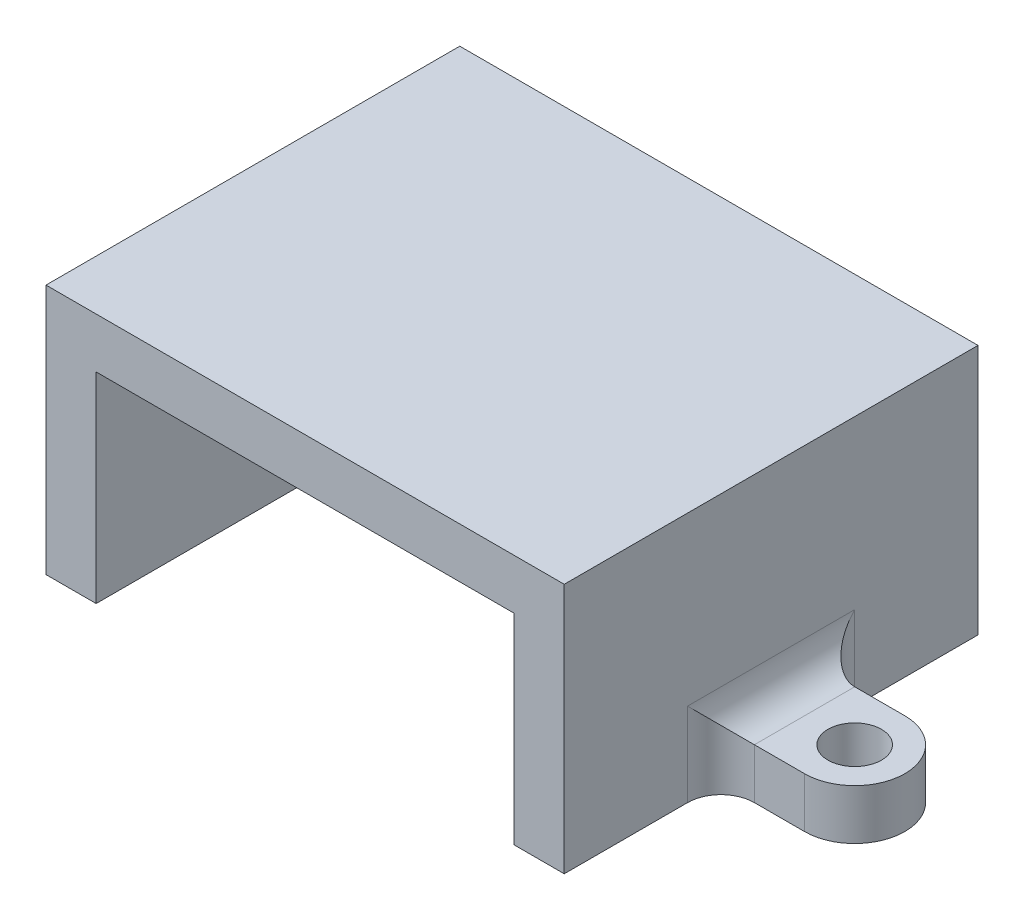
ISO-10303-21;
HEADER;
FILE_DESCRIPTION(('STEP AP214'),'2;1');
FILE_NAME('part.step','',(''),(''),'','','');
FILE_SCHEMA(('AUTOMOTIVE_DESIGN { 1 0 10303 214 1 1 1 1 }'));
ENDSEC;
DATA;
#1=APPLICATION_CONTEXT('core data for automotive mechanical design processes');
#2=APPLICATION_PROTOCOL_DEFINITION('international standard','automotive_design',2000,#1);
#3=PRODUCT_CONTEXT('',#1,'mechanical');
#4=PRODUCT('Part','Part','',(#3));
#5=PRODUCT_RELATED_PRODUCT_CATEGORY('part','',(#4));
#6=PRODUCT_DEFINITION_FORMATION('','',#4);
#7=PRODUCT_DEFINITION_CONTEXT('part definition',#1,'design');
#8=PRODUCT_DEFINITION('design','',#6,#7);
#9=PRODUCT_DEFINITION_SHAPE('','',#8);
#10=(LENGTH_UNIT() NAMED_UNIT(*) SI_UNIT(.MILLI.,.METRE.));
#11=(NAMED_UNIT(*) PLANE_ANGLE_UNIT() SI_UNIT($,.RADIAN.));
#12=(NAMED_UNIT(*) SI_UNIT($,.STERADIAN.) SOLID_ANGLE_UNIT());
#13=UNCERTAINTY_MEASURE_WITH_UNIT(LENGTH_MEASURE(1.E-05),#10,'distance_accuracy_value','');
#14=(GEOMETRIC_REPRESENTATION_CONTEXT(3) GLOBAL_UNCERTAINTY_ASSIGNED_CONTEXT((#13)) GLOBAL_UNIT_ASSIGNED_CONTEXT((#10,
#11,#12)) REPRESENTATION_CONTEXT('',''));
#15=CARTESIAN_POINT('',(0.,0.,0.));
#16=DIRECTION('',(0.,0.,1.));
#17=DIRECTION('',(1.,0.,0.));
#18=AXIS2_PLACEMENT_3D('',#15,#16,#17);
#19=CARTESIAN_POINT('',(31.,0.,24.75));
#20=DIRECTION('',(-1.,0.,0.));
#21=DIRECTION('',(0.,0.,1.));
#22=AXIS2_PLACEMENT_3D('',#19,#20,#21);
#23=PLANE('',#22);
#24=DIRECTION('',(0.,0.,-1.));
#25=VECTOR('',#24,1.);
#26=CARTESIAN_POINT('',(31.,0.,24.75));
#27=LINE('',#26,#25);
#28=CARTESIAN_POINT('',(31.,0.,24.75));
#29=VERTEX_POINT('',#28);
#30=CARTESIAN_POINT('',(31.,0.,17.375));
#31=VERTEX_POINT('',#30);
#32=EDGE_CURVE('E321',#29,#31,#27,.T.);
#33=ORIENTED_EDGE('',*,*,#32,.T.);
#34=DIRECTION('',(0.,-1.,0.));
#35=VECTOR('',#34,1.);
#36=CARTESIAN_POINT('',(31.,0.,17.375));
#37=LINE('',#36,#35);
#38=CARTESIAN_POINT('',(31.,5.,17.375));
#39=VERTEX_POINT('',#38);
#40=EDGE_CURVE('E374',#31,#39,#37,.F.);
#41=ORIENTED_EDGE('',*,*,#40,.T.);
#42=DIRECTION('',(0.,0.,-1.));
#43=VECTOR('',#42,1.);
#44=CARTESIAN_POINT('',(31.,5.,9.375));
#45=LINE('',#44,#43);
#46=CARTESIAN_POINT('',(31.,5.,7.375));
#47=VERTEX_POINT('',#46);
#48=EDGE_CURVE('E368',#39,#47,#45,.T.);
#49=ORIENTED_EDGE('',*,*,#48,.T.);
#50=DIRECTION('',(0.,-1.,0.));
#51=VECTOR('',#50,1.);
#52=CARTESIAN_POINT('',(31.,0.,7.375));
#53=LINE('',#52,#51);
#54=CARTESIAN_POINT('',(31.,0.,7.375));
#55=VERTEX_POINT('',#54);
#56=EDGE_CURVE('E371',#47,#55,#53,.T.);
#57=ORIENTED_EDGE('',*,*,#56,.T.);
#58=CARTESIAN_POINT('',(31.,0.,0.));
#59=VERTEX_POINT('',#58);
#60=EDGE_CURVE('E320',#55,#59,#27,.T.);
#61=ORIENTED_EDGE('',*,*,#60,.T.);
#62=DIRECTION('',(0.,1.,0.));
#63=VECTOR('',#62,1.);
#64=CARTESIAN_POINT('',(31.,0.,0.));
#65=LINE('',#64,#63);
#66=CARTESIAN_POINT('',(31.,15.,0.));
#67=VERTEX_POINT('',#66);
#68=EDGE_CURVE('E308',#59,#67,#65,.T.);
#69=ORIENTED_EDGE('',*,*,#68,.T.);
#70=DIRECTION('',(0.,0.,-1.));
#71=VECTOR('',#70,1.);
#72=CARTESIAN_POINT('',(31.,15.,24.75));
#73=LINE('',#72,#71);
#74=CARTESIAN_POINT('',(31.,15.,24.75));
#75=VERTEX_POINT('',#74);
#76=EDGE_CURVE('E316',#75,#67,#73,.T.);
#77=ORIENTED_EDGE('',*,*,#76,.F.);
#78=DIRECTION('',(0.,1.,0.));
#79=VECTOR('',#78,1.);
#80=CARTESIAN_POINT('',(31.,0.,24.75));
#81=LINE('',#80,#79);
#82=EDGE_CURVE('E282',#29,#75,#81,.T.);
#83=ORIENTED_EDGE('',*,*,#82,.F.);
#84=EDGE_LOOP('',(#33,#41,#49,#57,#61,#69,#77,#83));
#85=FACE_BOUND('',#84,.T.);
#86=ADVANCED_FACE('F39',(#85),#23,.F.);
#87=CARTESIAN_POINT('',(0.,15.,24.75));
#88=DIRECTION('',(1.,0.,0.));
#89=DIRECTION('',(0.,0.,-1.));
#90=AXIS2_PLACEMENT_3D('',#87,#88,#89);
#91=PLANE('',#90);
#92=DIRECTION('',(0.,0.,1.));
#93=VECTOR('',#92,1.);
#94=CARTESIAN_POINT('',(0.,5.,24.75));
#95=LINE('',#94,#93);
#96=CARTESIAN_POINT('',(0.,5.,7.375));
#97=VERTEX_POINT('',#96);
#98=CARTESIAN_POINT('',(0.,5.,17.375));
#99=VERTEX_POINT('',#98);
#100=EDGE_CURVE('E346',#97,#99,#95,.T.);
#101=ORIENTED_EDGE('',*,*,#100,.T.);
#102=DIRECTION('',(0.,-1.,0.));
#103=VECTOR('',#102,1.);
#104=CARTESIAN_POINT('',(0.,15.,17.375));
#105=LINE('',#104,#103);
#106=CARTESIAN_POINT('',(0.,0.,17.375));
#107=VERTEX_POINT('',#106);
#108=EDGE_CURVE('E352',#99,#107,#105,.T.);
#109=ORIENTED_EDGE('',*,*,#108,.T.);
#110=DIRECTION('',(0.,0.,-1.));
#111=VECTOR('',#110,1.);
#112=CARTESIAN_POINT('',(0.,0.,24.75));
#113=LINE('',#112,#111);
#114=CARTESIAN_POINT('',(0.,0.,24.75));
#115=VERTEX_POINT('',#114);
#116=EDGE_CURVE('E342',#115,#107,#113,.T.);
#117=ORIENTED_EDGE('',*,*,#116,.F.);
#118=DIRECTION('',(0.,-1.,0.));
#119=VECTOR('',#118,1.);
#120=CARTESIAN_POINT('',(0.,15.,24.75));
#121=LINE('',#120,#119);
#122=CARTESIAN_POINT('',(0.,15.,24.75));
#123=VERTEX_POINT('',#122);
#124=EDGE_CURVE('E262',#123,#115,#121,.T.);
#125=ORIENTED_EDGE('',*,*,#124,.F.);
#126=DIRECTION('',(0.,0.,-1.));
#127=VECTOR('',#126,1.);
#128=CARTESIAN_POINT('',(0.,15.,24.75));
#129=LINE('',#128,#127);
#130=CARTESIAN_POINT('',(0.,15.,0.));
#131=VERTEX_POINT('',#130);
#132=EDGE_CURVE('E288',#123,#131,#129,.T.);
#133=ORIENTED_EDGE('',*,*,#132,.T.);
#134=DIRECTION('',(0.,-1.,0.));
#135=VECTOR('',#134,1.);
#136=CARTESIAN_POINT('',(0.,15.,0.));
#137=LINE('',#136,#135);
#138=CARTESIAN_POINT('',(0.,0.,0.));
#139=VERTEX_POINT('',#138);
#140=EDGE_CURVE('E258',#131,#139,#137,.T.);
#141=ORIENTED_EDGE('',*,*,#140,.T.);
#142=CARTESIAN_POINT('',(0.,0.,7.375));
#143=VERTEX_POINT('',#142);
#144=EDGE_CURVE('E341',#143,#139,#113,.T.);
#145=ORIENTED_EDGE('',*,*,#144,.F.);
#146=DIRECTION('',(0.,-1.,0.));
#147=VECTOR('',#146,1.);
#148=CARTESIAN_POINT('',(0.,15.,7.375));
#149=LINE('',#148,#147);
#150=EDGE_CURVE('E349',#143,#97,#149,.F.);
#151=ORIENTED_EDGE('',*,*,#150,.T.);
#152=EDGE_LOOP('',(#101,#109,#117,#125,#133,#141,#145,#151));
#153=FACE_BOUND('',#152,.T.);
#154=ADVANCED_FACE('F432',(#153),#91,.F.);
#155=CARTESIAN_POINT('',(0.,0.,24.75));
#156=DIRECTION('',(0.,1.,0.));
#157=DIRECTION('',(0.,0.,1.));
#158=AXIS2_PLACEMENT_3D('',#155,#156,#157);
#159=PLANE('',#158);
#160=DIRECTION('',(1.,0.,0.));
#161=VECTOR('',#160,1.);
#162=CARTESIAN_POINT('',(0.,0.,0.));
#163=LINE('',#162,#161);
#164=CARTESIAN_POINT('',(3.,0.,0.));
#165=VERTEX_POINT('',#164);
#166=EDGE_CURVE('E292',#139,#165,#163,.T.);
#167=ORIENTED_EDGE('',*,*,#166,.T.);
#168=DIRECTION('',(0.,0.,-1.));
#169=VECTOR('',#168,1.);
#170=CARTESIAN_POINT('',(3.,0.,24.75));
#171=LINE('',#170,#169);
#172=CARTESIAN_POINT('',(3.,0.,24.75));
#173=VERTEX_POINT('',#172);
#174=EDGE_CURVE('E337',#173,#165,#171,.T.);
#175=ORIENTED_EDGE('',*,*,#174,.F.);
#176=DIRECTION('',(1.,0.,0.));
#177=VECTOR('',#176,1.);
#178=CARTESIAN_POINT('',(0.,0.,24.75));
#179=LINE('',#178,#177);
#180=EDGE_CURVE('E266',#115,#173,#179,.T.);
#181=ORIENTED_EDGE('',*,*,#180,.F.);
#182=ORIENTED_EDGE('',*,*,#116,.T.);
#183=CARTESIAN_POINT('',(-2.,0.,17.375));
#184=DIRECTION('',(0.,1.,0.));
#185=DIRECTION('',(0.,0.,1.));
#186=AXIS2_PLACEMENT_3D('',#183,#184,#185);
#187=CIRCLE('',#186,2.);
#188=CARTESIAN_POINT('',(-2.,0.,15.375));
#189=VERTEX_POINT('',#188);
#190=EDGE_CURVE('E381',#107,#189,#187,.T.);
#191=ORIENTED_EDGE('',*,*,#190,.T.);
#192=DIRECTION('',(-1.,0.,0.));
#193=VECTOR('',#192,1.);
#194=CARTESIAN_POINT('',(0.,0.,15.375));
#195=LINE('',#194,#193);
#196=CARTESIAN_POINT('',(-5.,0.,15.375));
#197=VERTEX_POINT('',#196);
#198=EDGE_CURVE('E229',#189,#197,#195,.T.);
#199=ORIENTED_EDGE('',*,*,#198,.T.);
#200=CARTESIAN_POINT('',(-5.,0.,12.375));
#201=DIRECTION('',(0.,-1.,0.));
#202=DIRECTION('',(0.,0.,1.));
#203=AXIS2_PLACEMENT_3D('',#200,#201,#202);
#204=CIRCLE('',#203,3.);
#205=CARTESIAN_POINT('',(-4.99999999999999,0.,9.375));
#206=VERTEX_POINT('',#205);
#207=EDGE_CURVE('E248',#197,#206,#204,.T.);
#208=ORIENTED_EDGE('',*,*,#207,.T.);
#209=DIRECTION('',(1.,0.,0.));
#210=VECTOR('',#209,1.);
#211=CARTESIAN_POINT('',(-4.99999999999999,0.,9.375));
#212=LINE('',#211,#210);
#213=CARTESIAN_POINT('',(-2.,0.,9.375));
#214=VERTEX_POINT('',#213);
#215=EDGE_CURVE('E237',#206,#214,#212,.T.);
#216=ORIENTED_EDGE('',*,*,#215,.T.);
#217=CARTESIAN_POINT('',(-2.,0.,7.375));
#218=DIRECTION('',(0.,1.,0.));
#219=DIRECTION('',(0.,0.,1.));
#220=AXIS2_PLACEMENT_3D('',#217,#218,#219);
#221=CIRCLE('',#220,2.);
#222=EDGE_CURVE('E384',#214,#143,#221,.T.);
#223=ORIENTED_EDGE('',*,*,#222,.T.);
#224=ORIENTED_EDGE('',*,*,#144,.T.);
#225=EDGE_LOOP('',(#167,#175,#181,#182,#191,#199,#208,#216,#223,#224));
#226=FACE_BOUND('',#225,.T.);
#227=CARTESIAN_POINT('',(-5.,0.,12.375));
#228=DIRECTION('',(0.,-1.,0.));
#229=DIRECTION('',(0.,0.,1.));
#230=AXIS2_PLACEMENT_3D('',#227,#228,#229);
#231=CIRCLE('',#230,1.6);
#232=CARTESIAN_POINT('',(-5.,0.,13.975));
#233=VERTEX_POINT('',#232);
#234=EDGE_CURVE('E223',#233,#233,#231,.T.);
#235=ORIENTED_EDGE('',*,*,#234,.F.);
#236=EDGE_LOOP('',(#235));
#237=FACE_BOUND('',#236,.T.);
#238=ADVANCED_FACE('F420',(#226,#237),#159,.F.);
#239=CARTESIAN_POINT('',(3.,0.,24.75));
#240=DIRECTION('',(-1.,0.,0.));
#241=DIRECTION('',(0.,-1.,0.));
#242=AXIS2_PLACEMENT_3D('',#239,#240,#241);
#243=PLANE('',#242);
#244=DIRECTION('',(0.,1.,0.));
#245=VECTOR('',#244,1.);
#246=CARTESIAN_POINT('',(3.,0.,0.));
#247=LINE('',#246,#245);
#248=CARTESIAN_POINT('',(3.,12.,0.));
#249=VERTEX_POINT('',#248);
#250=EDGE_CURVE('E295',#165,#249,#247,.T.);
#251=ORIENTED_EDGE('',*,*,#250,.T.);
#252=DIRECTION('',(0.,0.,-1.));
#253=VECTOR('',#252,1.);
#254=CARTESIAN_POINT('',(3.,12.,24.75));
#255=LINE('',#254,#253);
#256=CARTESIAN_POINT('',(3.,12.,24.75));
#257=VERTEX_POINT('',#256);
#258=EDGE_CURVE('E333',#257,#249,#255,.T.);
#259=ORIENTED_EDGE('',*,*,#258,.F.);
#260=DIRECTION('',(0.,1.,0.));
#261=VECTOR('',#260,1.);
#262=CARTESIAN_POINT('',(3.,0.,24.75));
#263=LINE('',#262,#261);
#264=EDGE_CURVE('E270',#173,#257,#263,.T.);
#265=ORIENTED_EDGE('',*,*,#264,.F.);
#266=ORIENTED_EDGE('',*,*,#174,.T.);
#267=EDGE_LOOP('',(#251,#259,#265,#266));
#268=FACE_BOUND('',#267,.T.);
#269=ADVANCED_FACE('F473',(#268),#243,.F.);
#270=CARTESIAN_POINT('',(3.,12.,24.75));
#271=DIRECTION('',(0.,1.,0.));
#272=DIRECTION('',(0.,0.,1.));
#273=AXIS2_PLACEMENT_3D('',#270,#271,#272);
#274=PLANE('',#273);
#275=DIRECTION('',(1.,0.,0.));
#276=VECTOR('',#275,1.);
#277=CARTESIAN_POINT('',(3.,12.,0.));
#278=LINE('',#277,#276);
#279=CARTESIAN_POINT('',(28.,12.,0.));
#280=VERTEX_POINT('',#279);
#281=EDGE_CURVE('E298',#249,#280,#278,.T.);
#282=ORIENTED_EDGE('',*,*,#281,.T.);
#283=DIRECTION('',(0.,0.,-1.));
#284=VECTOR('',#283,1.);
#285=CARTESIAN_POINT('',(28.,12.,24.75));
#286=LINE('',#285,#284);
#287=CARTESIAN_POINT('',(28.,12.,24.75));
#288=VERTEX_POINT('',#287);
#289=EDGE_CURVE('E329',#288,#280,#286,.T.);
#290=ORIENTED_EDGE('',*,*,#289,.F.);
#291=DIRECTION('',(1.,0.,0.));
#292=VECTOR('',#291,1.);
#293=CARTESIAN_POINT('',(3.,12.,24.75));
#294=LINE('',#293,#292);
#295=EDGE_CURVE('E273',#257,#288,#294,.T.);
#296=ORIENTED_EDGE('',*,*,#295,.F.);
#297=ORIENTED_EDGE('',*,*,#258,.T.);
#298=EDGE_LOOP('',(#282,#290,#296,#297));
#299=FACE_BOUND('',#298,.T.);
#300=ADVANCED_FACE('F469',(#299),#274,.F.);
#301=CARTESIAN_POINT('',(28.,12.,24.75));
#302=DIRECTION('',(1.,0.,0.));
#303=DIRECTION('',(0.,0.,-1.));
#304=AXIS2_PLACEMENT_3D('',#301,#302,#303);
#305=PLANE('',#304);
#306=DIRECTION('',(0.,-1.,0.));
#307=VECTOR('',#306,1.);
#308=CARTESIAN_POINT('',(28.,12.,0.));
#309=LINE('',#308,#307);
#310=CARTESIAN_POINT('',(28.,0.,0.));
#311=VERTEX_POINT('',#310);
#312=EDGE_CURVE('E301',#280,#311,#309,.T.);
#313=ORIENTED_EDGE('',*,*,#312,.T.);
#314=DIRECTION('',(0.,0.,-1.));
#315=VECTOR('',#314,1.);
#316=CARTESIAN_POINT('',(28.,0.,24.75));
#317=LINE('',#316,#315);
#318=CARTESIAN_POINT('',(28.,0.,24.75));
#319=VERTEX_POINT('',#318);
#320=EDGE_CURVE('E325',#319,#311,#317,.T.);
#321=ORIENTED_EDGE('',*,*,#320,.F.);
#322=DIRECTION('',(0.,-1.,0.));
#323=VECTOR('',#322,1.);
#324=CARTESIAN_POINT('',(28.,12.,24.75));
#325=LINE('',#324,#323);
#326=EDGE_CURVE('E276',#288,#319,#325,.T.);
#327=ORIENTED_EDGE('',*,*,#326,.F.);
#328=ORIENTED_EDGE('',*,*,#289,.T.);
#329=EDGE_LOOP('',(#313,#321,#327,#328));
#330=FACE_BOUND('',#329,.T.);
#331=ADVANCED_FACE('F466',(#330),#305,.F.);
#332=CARTESIAN_POINT('',(28.,0.,24.75));
#333=DIRECTION('',(0.,1.,0.));
#334=DIRECTION('',(0.,0.,1.));
#335=AXIS2_PLACEMENT_3D('',#332,#333,#334);
#336=PLANE('',#335);
#337=DIRECTION('',(1.,0.,0.));
#338=VECTOR('',#337,1.);
#339=CARTESIAN_POINT('',(28.,0.,0.));
#340=LINE('',#339,#338);
#341=EDGE_CURVE('E304',#311,#59,#340,.T.);
#342=ORIENTED_EDGE('',*,*,#341,.T.);
#343=ORIENTED_EDGE('',*,*,#60,.F.);
#344=CARTESIAN_POINT('',(33.,0.,7.375));
#345=DIRECTION('',(0.,1.,0.));
#346=DIRECTION('',(0.,0.,1.));
#347=AXIS2_PLACEMENT_3D('',#344,#345,#346);
#348=CIRCLE('',#347,2.);
#349=CARTESIAN_POINT('',(33.,0.,9.375));
#350=VERTEX_POINT('',#349);
#351=EDGE_CURVE('E11',#55,#350,#348,.T.);
#352=ORIENTED_EDGE('',*,*,#351,.T.);
#353=DIRECTION('',(1.,0.,0.));
#354=VECTOR('',#353,1.);
#355=CARTESIAN_POINT('',(36.,0.,9.375));
#356=LINE('',#355,#354);
#357=CARTESIAN_POINT('',(36.,0.,9.375));
#358=VERTEX_POINT('',#357);
#359=EDGE_CURVE('E206',#350,#358,#356,.T.);
#360=ORIENTED_EDGE('',*,*,#359,.T.);
#361=CARTESIAN_POINT('',(36.,0.,12.375));
#362=DIRECTION('',(0.,-1.,0.));
#363=DIRECTION('',(0.,0.,-1.));
#364=AXIS2_PLACEMENT_3D('',#361,#362,#363);
#365=CIRCLE('',#364,3.);
#366=CARTESIAN_POINT('',(36.,0.,15.375));
#367=VERTEX_POINT('',#366);
#368=EDGE_CURVE('E216',#358,#367,#365,.T.);
#369=ORIENTED_EDGE('',*,*,#368,.T.);
#370=DIRECTION('',(-1.,0.,0.));
#371=VECTOR('',#370,1.);
#372=CARTESIAN_POINT('',(31.,0.,15.375));
#373=LINE('',#372,#371);
#374=CARTESIAN_POINT('',(33.,0.,15.375));
#375=VERTEX_POINT('',#374);
#376=EDGE_CURVE('E185',#367,#375,#373,.T.);
#377=ORIENTED_EDGE('',*,*,#376,.T.);
#378=CARTESIAN_POINT('',(33.,0.,17.375));
#379=DIRECTION('',(0.,1.,0.));
#380=DIRECTION('',(0.,0.,1.));
#381=AXIS2_PLACEMENT_3D('',#378,#379,#380);
#382=CIRCLE('',#381,2.);
#383=EDGE_CURVE('E49',#375,#31,#382,.T.);
#384=ORIENTED_EDGE('',*,*,#383,.T.);
#385=ORIENTED_EDGE('',*,*,#32,.F.);
#386=DIRECTION('',(1.,0.,0.));
#387=VECTOR('',#386,1.);
#388=CARTESIAN_POINT('',(28.,0.,24.75));
#389=LINE('',#388,#387);
#390=EDGE_CURVE('E279',#319,#29,#389,.T.);
#391=ORIENTED_EDGE('',*,*,#390,.F.);
#392=ORIENTED_EDGE('',*,*,#320,.T.);
#393=EDGE_LOOP('',(#342,#343,#352,#360,#369,#377,#384,#385,#391,#392));
#394=FACE_BOUND('',#393,.T.);
#395=CARTESIAN_POINT('',(36.,0.,12.375));
#396=DIRECTION('',(0.,-1.,0.));
#397=DIRECTION('',(0.,0.,-1.));
#398=AXIS2_PLACEMENT_3D('',#395,#396,#397);
#399=CIRCLE('',#398,1.6);
#400=CARTESIAN_POINT('',(36.,0.,10.775));
#401=VERTEX_POINT('',#400);
#402=EDGE_CURVE('E211',#401,#401,#399,.T.);
#403=ORIENTED_EDGE('',*,*,#402,.F.);
#404=EDGE_LOOP('',(#403));
#405=FACE_BOUND('',#404,.T.);
#406=ADVANCED_FACE('F411',(#394,#405),#336,.F.);
#407=CARTESIAN_POINT('',(31.,15.,24.75));
#408=DIRECTION('',(0.,-1.,0.));
#409=DIRECTION('',(1.,0.,0.));
#410=AXIS2_PLACEMENT_3D('',#407,#408,#409);
#411=PLANE('',#410);
#412=DIRECTION('',(-1.,0.,0.));
#413=VECTOR('',#412,1.);
#414=CARTESIAN_POINT('',(31.,15.,0.));
#415=LINE('',#414,#413);
#416=EDGE_CURVE('E267',#67,#131,#415,.T.);
#417=ORIENTED_EDGE('',*,*,#416,.T.);
#418=ORIENTED_EDGE('',*,*,#132,.F.);
#419=DIRECTION('',(-1.,0.,0.));
#420=VECTOR('',#419,1.);
#421=CARTESIAN_POINT('',(31.,15.,24.75));
#422=LINE('',#421,#420);
#423=EDGE_CURVE('E285',#75,#123,#422,.T.);
#424=ORIENTED_EDGE('',*,*,#423,.F.);
#425=ORIENTED_EDGE('',*,*,#76,.T.);
#426=EDGE_LOOP('',(#417,#418,#424,#425));
#427=FACE_BOUND('',#426,.T.);
#428=ADVANCED_FACE('F438',(#427),#411,.F.);
#429=CARTESIAN_POINT('',(0.,0.,24.75));
#430=DIRECTION('',(0.,0.,1.));
#431=DIRECTION('',(1.,0.,0.));
#432=AXIS2_PLACEMENT_3D('',#429,#430,#431);
#433=PLANE('',#432);
#434=ORIENTED_EDGE('',*,*,#124,.T.);
#435=ORIENTED_EDGE('',*,*,#180,.T.);
#436=ORIENTED_EDGE('',*,*,#264,.T.);
#437=ORIENTED_EDGE('',*,*,#295,.T.);
#438=ORIENTED_EDGE('',*,*,#326,.T.);
#439=ORIENTED_EDGE('',*,*,#390,.T.);
#440=ORIENTED_EDGE('',*,*,#82,.T.);
#441=ORIENTED_EDGE('',*,*,#423,.T.);
#442=EDGE_LOOP('',(#434,#435,#436,#437,#438,#439,#440,#441));
#443=FACE_BOUND('',#442,.T.);
#444=ADVANCED_FACE('F444',(#443),#433,.T.);
#445=CARTESIAN_POINT('',(0.,0.,0.));
#446=DIRECTION('',(0.,0.,1.));
#447=DIRECTION('',(1.,0.,0.));
#448=AXIS2_PLACEMENT_3D('',#445,#446,#447);
#449=PLANE('',#448);
#450=ORIENTED_EDGE('',*,*,#140,.F.);
#451=ORIENTED_EDGE('',*,*,#416,.F.);
#452=ORIENTED_EDGE('',*,*,#68,.F.);
#453=ORIENTED_EDGE('',*,*,#341,.F.);
#454=ORIENTED_EDGE('',*,*,#312,.F.);
#455=ORIENTED_EDGE('',*,*,#281,.F.);
#456=ORIENTED_EDGE('',*,*,#250,.F.);
#457=ORIENTED_EDGE('',*,*,#166,.F.);
#458=EDGE_LOOP('',(#450,#451,#452,#453,#454,#455,#456,#457));
#459=FACE_BOUND('',#458,.T.);
#460=ADVANCED_FACE('F429',(#459),#449,.F.);
#461=CARTESIAN_POINT('',(0.,3.,15.375));
#462=DIRECTION('',(0.,0.,1.));
#463=DIRECTION('',(1.,0.,0.));
#464=AXIS2_PLACEMENT_3D('',#461,#462,#463);
#465=PLANE('',#464);
#466=ORIENTED_EDGE('',*,*,#198,.F.);
#467=DIRECTION('',(0.,-1.,0.));
#468=VECTOR('',#467,1.);
#469=CARTESIAN_POINT('',(-2.,3.,15.375));
#470=LINE('',#469,#468);
#471=CARTESIAN_POINT('',(-2.,3.,15.375));
#472=VERTEX_POINT('',#471);
#473=EDGE_CURVE('E356',#189,#472,#470,.F.);
#474=ORIENTED_EDGE('',*,*,#473,.T.);
#475=DIRECTION('',(-1.,0.,0.));
#476=VECTOR('',#475,1.);
#477=CARTESIAN_POINT('',(0.,3.,15.375));
#478=LINE('',#477,#476);
#479=CARTESIAN_POINT('',(-5.,3.,15.375));
#480=VERTEX_POINT('',#479);
#481=EDGE_CURVE('E233',#472,#480,#478,.T.);
#482=ORIENTED_EDGE('',*,*,#481,.T.);
#483=DIRECTION('',(0.,-1.,0.));
#484=VECTOR('',#483,1.);
#485=CARTESIAN_POINT('',(-5.,3.,15.375));
#486=LINE('',#485,#484);
#487=EDGE_CURVE('E245',#480,#197,#486,.T.);
#488=ORIENTED_EDGE('',*,*,#487,.T.);
#489=EDGE_LOOP('',(#466,#474,#482,#488));
#490=FACE_BOUND('',#489,.T.);
#491=ADVANCED_FACE('F505',(#490),#465,.T.);
#492=CARTESIAN_POINT('',(-4.99999999999999,3.,9.375));
#493=DIRECTION('',(0.,0.,-1.));
#494=DIRECTION('',(-1.,0.,0.));
#495=AXIS2_PLACEMENT_3D('',#492,#493,#494);
#496=PLANE('',#495);
#497=DIRECTION('',(1.,0.,0.));
#498=VECTOR('',#497,1.);
#499=CARTESIAN_POINT('',(-4.99999999999999,3.,9.375));
#500=LINE('',#499,#498);
#501=CARTESIAN_POINT('',(-4.99999999999999,3.,9.375));
#502=VERTEX_POINT('',#501);
#503=CARTESIAN_POINT('',(-2.,3.,9.375));
#504=VERTEX_POINT('',#503);
#505=EDGE_CURVE('E241',#502,#504,#500,.T.);
#506=ORIENTED_EDGE('',*,*,#505,.T.);
#507=DIRECTION('',(0.,-1.,0.));
#508=VECTOR('',#507,1.);
#509=CARTESIAN_POINT('',(-2.,3.,9.375));
#510=LINE('',#509,#508);
#511=EDGE_CURVE('E359',#504,#214,#510,.T.);
#512=ORIENTED_EDGE('',*,*,#511,.T.);
#513=ORIENTED_EDGE('',*,*,#215,.F.);
#514=DIRECTION('',(0.,-1.,0.));
#515=VECTOR('',#514,1.);
#516=CARTESIAN_POINT('',(-4.99999999999999,3.,9.375));
#517=LINE('',#516,#515);
#518=EDGE_CURVE('E255',#502,#206,#517,.T.);
#519=ORIENTED_EDGE('',*,*,#518,.F.);
#520=EDGE_LOOP('',(#506,#512,#513,#519));
#521=FACE_BOUND('',#520,.T.);
#522=ADVANCED_FACE('F514',(#521),#496,.T.);
#523=CARTESIAN_POINT('',(-5.,3.,12.375));
#524=DIRECTION('',(0.,-1.,0.));
#525=DIRECTION('',(0.,0.,-1.));
#526=AXIS2_PLACEMENT_3D('',#523,#524,#525);
#527=CYLINDRICAL_SURFACE('',#526,3.);
#528=ORIENTED_EDGE('',*,*,#207,.F.);
#529=ORIENTED_EDGE('',*,*,#487,.F.);
#530=CARTESIAN_POINT('',(-5.,3.,12.375));
#531=DIRECTION('',(0.,-1.,0.));
#532=DIRECTION('',(0.,0.,1.));
#533=AXIS2_PLACEMENT_3D('',#530,#531,#532);
#534=CIRCLE('',#533,3.);
#535=EDGE_CURVE('E236',#480,#502,#534,.T.);
#536=ORIENTED_EDGE('',*,*,#535,.T.);
#537=ORIENTED_EDGE('',*,*,#518,.T.);
#538=EDGE_LOOP('',(#528,#529,#536,#537));
#539=FACE_BOUND('',#538,.T.);
#540=ADVANCED_FACE('F511',(#539),#527,.T.);
#541=CARTESIAN_POINT('',(-5.,3.,12.375));
#542=DIRECTION('',(0.,1.,0.));
#543=DIRECTION('',(0.,0.,1.));
#544=AXIS2_PLACEMENT_3D('',#541,#542,#543);
#545=PLANE('',#544);
#546=CARTESIAN_POINT('',(-5.,3.,12.375));
#547=DIRECTION('',(0.,-1.,0.));
#548=DIRECTION('',(0.,0.,1.));
#549=AXIS2_PLACEMENT_3D('',#546,#547,#548);
#550=CIRCLE('',#549,1.6);
#551=CARTESIAN_POINT('',(-5.,3.,13.975));
#552=VERTEX_POINT('',#551);
#553=EDGE_CURVE('E225',#552,#552,#550,.T.);
#554=ORIENTED_EDGE('',*,*,#553,.T.);
#555=EDGE_LOOP('',(#554));
#556=FACE_BOUND('',#555,.T.);
#557=ORIENTED_EDGE('',*,*,#481,.F.);
#558=DIRECTION('',(0.,0.,1.));
#559=VECTOR('',#558,1.);
#560=CARTESIAN_POINT('',(-2.,3.,12.375));
#561=LINE('',#560,#559);
#562=EDGE_CURVE('E362',#472,#504,#561,.F.);
#563=ORIENTED_EDGE('',*,*,#562,.T.);
#564=ORIENTED_EDGE('',*,*,#505,.F.);
#565=ORIENTED_EDGE('',*,*,#535,.F.);
#566=EDGE_LOOP('',(#557,#563,#564,#565));
#567=FACE_BOUND('',#566,.T.);
#568=ADVANCED_FACE('F517',(#556,#567),#545,.T.);
#569=CARTESIAN_POINT('',(-5.,3.,12.375));
#570=DIRECTION('',(0.,-1.,0.));
#571=DIRECTION('',(0.,0.,-1.));
#572=AXIS2_PLACEMENT_3D('',#569,#570,#571);
#573=CYLINDRICAL_SURFACE('',#572,1.6);
#574=ORIENTED_EDGE('',*,*,#553,.F.);
#575=EDGE_LOOP('',(#574));
#576=FACE_BOUND('',#575,.T.);
#577=ORIENTED_EDGE('',*,*,#234,.T.);
#578=EDGE_LOOP('',(#577));
#579=FACE_BOUND('',#578,.T.);
#580=ADVANCED_FACE('F519',(#576,#579),#573,.F.);
#581=CARTESIAN_POINT('',(36.,3.,12.375));
#582=DIRECTION('',(0.,-1.,0.));
#583=DIRECTION('',(0.,0.,-1.));
#584=AXIS2_PLACEMENT_3D('',#581,#582,#583);
#585=CYLINDRICAL_SURFACE('',#584,3.);
#586=ORIENTED_EDGE('',*,*,#368,.F.);
#587=DIRECTION('',(0.,-1.,0.));
#588=VECTOR('',#587,1.);
#589=CARTESIAN_POINT('',(36.,3.,9.375));
#590=LINE('',#589,#588);
#591=CARTESIAN_POINT('',(36.,3.,9.375));
#592=VERTEX_POINT('',#591);
#593=EDGE_CURVE('E191',#592,#358,#590,.T.);
#594=ORIENTED_EDGE('',*,*,#593,.F.);
#595=CARTESIAN_POINT('',(36.,3.,12.375));
#596=DIRECTION('',(0.,-1.,0.));
#597=DIRECTION('',(0.,0.,-1.));
#598=AXIS2_PLACEMENT_3D('',#595,#596,#597);
#599=CIRCLE('',#598,3.);
#600=CARTESIAN_POINT('',(36.,3.,15.375));
#601=VERTEX_POINT('',#600);
#602=EDGE_CURVE('E197',#592,#601,#599,.T.);
#603=ORIENTED_EDGE('',*,*,#602,.T.);
#604=DIRECTION('',(0.,-1.,0.));
#605=VECTOR('',#604,1.);
#606=CARTESIAN_POINT('',(36.,3.,15.375));
#607=LINE('',#606,#605);
#608=EDGE_CURVE('E178',#601,#367,#607,.T.);
#609=ORIENTED_EDGE('',*,*,#608,.T.);
#610=EDGE_LOOP('',(#586,#594,#603,#609));
#611=FACE_BOUND('',#610,.T.);
#612=ADVANCED_FACE('F203',(#611),#585,.T.);
#613=CARTESIAN_POINT('',(36.,3.,9.375));
#614=DIRECTION('',(0.,0.,-1.));
#615=DIRECTION('',(-1.,0.,0.));
#616=AXIS2_PLACEMENT_3D('',#613,#614,#615);
#617=PLANE('',#616);
#618=ORIENTED_EDGE('',*,*,#359,.F.);
#619=DIRECTION('',(0.,-1.,0.));
#620=VECTOR('',#619,1.);
#621=CARTESIAN_POINT('',(33.,3.,9.375));
#622=LINE('',#621,#620);
#623=CARTESIAN_POINT('',(33.,3.,9.375));
#624=VERTEX_POINT('',#623);
#625=EDGE_CURVE('E57',#350,#624,#622,.F.);
#626=ORIENTED_EDGE('',*,*,#625,.T.);
#627=DIRECTION('',(1.,0.,0.));
#628=VECTOR('',#627,1.);
#629=CARTESIAN_POINT('',(36.,3.,9.375));
#630=LINE('',#629,#628);
#631=EDGE_CURVE('E192',#624,#592,#630,.T.);
#632=ORIENTED_EDGE('',*,*,#631,.T.);
#633=ORIENTED_EDGE('',*,*,#593,.T.);
#634=EDGE_LOOP('',(#618,#626,#632,#633));
#635=FACE_BOUND('',#634,.T.);
#636=ADVANCED_FACE('F571',(#635),#617,.T.);
#637=CARTESIAN_POINT('',(31.,3.,15.375));
#638=DIRECTION('',(0.,0.,1.));
#639=DIRECTION('',(1.,0.,0.));
#640=AXIS2_PLACEMENT_3D('',#637,#638,#639);
#641=PLANE('',#640);
#642=DIRECTION('',(-1.,0.,0.));
#643=VECTOR('',#642,1.);
#644=CARTESIAN_POINT('',(31.,3.,15.375));
#645=LINE('',#644,#643);
#646=CARTESIAN_POINT('',(33.,3.,15.375));
#647=VERTEX_POINT('',#646);
#648=EDGE_CURVE('E182',#601,#647,#645,.T.);
#649=ORIENTED_EDGE('',*,*,#648,.T.);
#650=DIRECTION('',(0.,-1.,0.));
#651=VECTOR('',#650,1.);
#652=CARTESIAN_POINT('',(33.,3.,15.375));
#653=LINE('',#652,#651);
#654=EDGE_CURVE('E365',#647,#375,#653,.T.);
#655=ORIENTED_EDGE('',*,*,#654,.T.);
#656=ORIENTED_EDGE('',*,*,#376,.F.);
#657=ORIENTED_EDGE('',*,*,#608,.F.);
#658=EDGE_LOOP('',(#649,#655,#656,#657));
#659=FACE_BOUND('',#658,.T.);
#660=ADVANCED_FACE('F180',(#659),#641,.T.);
#661=CARTESIAN_POINT('',(36.,3.,12.375));
#662=DIRECTION('',(0.,-1.,0.));
#663=DIRECTION('',(0.,0.,-1.));
#664=AXIS2_PLACEMENT_3D('',#661,#662,#663);
#665=PLANE('',#664);
#666=CARTESIAN_POINT('',(36.,3.,12.375));
#667=DIRECTION('',(0.,-1.,0.));
#668=DIRECTION('',(0.,0.,-1.));
#669=AXIS2_PLACEMENT_3D('',#666,#667,#668);
#670=CIRCLE('',#669,1.6);
#671=CARTESIAN_POINT('',(36.,3.,10.775));
#672=VERTEX_POINT('',#671);
#673=EDGE_CURVE('E219',#672,#672,#670,.T.);
#674=ORIENTED_EDGE('',*,*,#673,.T.);
#675=EDGE_LOOP('',(#674));
#676=FACE_BOUND('',#675,.T.);
#677=ORIENTED_EDGE('',*,*,#631,.F.);
#678=DIRECTION('',(0.,0.,-1.));
#679=VECTOR('',#678,1.);
#680=CARTESIAN_POINT('',(33.,3.,15.375));
#681=LINE('',#680,#679);
#682=EDGE_CURVE('E199',#624,#647,#681,.F.);
#683=ORIENTED_EDGE('',*,*,#682,.T.);
#684=ORIENTED_EDGE('',*,*,#648,.F.);
#685=ORIENTED_EDGE('',*,*,#602,.F.);
#686=EDGE_LOOP('',(#677,#683,#684,#685));
#687=FACE_BOUND('',#686,.T.);
#688=ADVANCED_FACE('F196',(#676,#687),#665,.F.);
#689=CARTESIAN_POINT('',(36.,3.,12.375));
#690=DIRECTION('',(0.,-1.,0.));
#691=DIRECTION('',(0.,0.,-1.));
#692=AXIS2_PLACEMENT_3D('',#689,#690,#691);
#693=CYLINDRICAL_SURFACE('',#692,1.6);
#694=ORIENTED_EDGE('',*,*,#673,.F.);
#695=EDGE_LOOP('',(#694));
#696=FACE_BOUND('',#695,.T.);
#697=ORIENTED_EDGE('',*,*,#402,.T.);
#698=EDGE_LOOP('',(#697));
#699=FACE_BOUND('',#698,.T.);
#700=ADVANCED_FACE('F489',(#696,#699),#693,.F.);
#701=CARTESIAN_POINT('',(-2.,3.,7.375));
#702=DIRECTION('',(0.,-1.,0.));
#703=DIRECTION('',(0.,0.,-1.));
#704=AXIS2_PLACEMENT_3D('',#701,#702,#703);
#705=CYLINDRICAL_SURFACE('',#704,2.);
#706=ORIENTED_EDGE('',*,*,#222,.F.);
#707=ORIENTED_EDGE('',*,*,#511,.F.);
#708=CARTESIAN_POINT('',(-2.,5.,7.375));
#709=DIRECTION('',(0.,0.707106781186547,0.707106781186547));
#710=DIRECTION('',(0.,-0.707106781186547,0.707106781186547));
#711=AXIS2_PLACEMENT_3D('',#708,#709,#710);
#712=ELLIPSE('',#711,2.82842712474619,2.);
#713=EDGE_CURVE('E393',#97,#504,#712,.F.);
#714=ORIENTED_EDGE('',*,*,#713,.F.);
#715=ORIENTED_EDGE('',*,*,#150,.F.);
#716=EDGE_LOOP('',(#706,#707,#714,#715));
#717=FACE_BOUND('',#716,.T.);
#718=ADVANCED_FACE('F486',(#717),#705,.F.);
#719=CARTESIAN_POINT('',(-2.,5.,24.75));
#720=DIRECTION('',(0.,0.,1.));
#721=DIRECTION('',(1.,0.,0.));
#722=AXIS2_PLACEMENT_3D('',#719,#720,#721);
#723=CYLINDRICAL_SURFACE('',#722,2.);
#724=ORIENTED_EDGE('',*,*,#713,.T.);
#725=ORIENTED_EDGE('',*,*,#562,.F.);
#726=CARTESIAN_POINT('',(-2.,5.,17.375));
#727=DIRECTION('',(0.,-0.707106781186547,0.707106781186547));
#728=DIRECTION('',(0.,0.707106781186547,0.707106781186547));
#729=AXIS2_PLACEMENT_3D('',#726,#727,#728);
#730=ELLIPSE('',#729,2.82842712474619,2.);
#731=EDGE_CURVE('E389',#99,#472,#730,.F.);
#732=ORIENTED_EDGE('',*,*,#731,.F.);
#733=ORIENTED_EDGE('',*,*,#100,.F.);
#734=EDGE_LOOP('',(#724,#725,#732,#733));
#735=FACE_BOUND('',#734,.T.);
#736=ADVANCED_FACE('F483',(#735),#723,.F.);
#737=CARTESIAN_POINT('',(-2.,15.,17.375));
#738=DIRECTION('',(0.,-1.,0.));
#739=DIRECTION('',(0.,0.,-1.));
#740=AXIS2_PLACEMENT_3D('',#737,#738,#739);
#741=CYLINDRICAL_SURFACE('',#740,2.);
#742=ORIENTED_EDGE('',*,*,#731,.T.);
#743=ORIENTED_EDGE('',*,*,#473,.F.);
#744=ORIENTED_EDGE('',*,*,#190,.F.);
#745=ORIENTED_EDGE('',*,*,#108,.F.);
#746=EDGE_LOOP('',(#742,#743,#744,#745));
#747=FACE_BOUND('',#746,.T.);
#748=ADVANCED_FACE('F480',(#747),#741,.F.);
#749=CARTESIAN_POINT('',(33.,0.,7.375));
#750=DIRECTION('',(0.,-1.,0.));
#751=DIRECTION('',(0.,0.,-1.));
#752=AXIS2_PLACEMENT_3D('',#749,#750,#751);
#753=CYLINDRICAL_SURFACE('',#752,2.);
#754=ORIENTED_EDGE('',*,*,#351,.F.);
#755=ORIENTED_EDGE('',*,*,#56,.F.);
#756=CARTESIAN_POINT('',(33.,5.,7.375));
#757=DIRECTION('',(0.,0.707106781186547,0.707106781186547));
#758=DIRECTION('',(0.,-0.707106781186547,0.707106781186547));
#759=AXIS2_PLACEMENT_3D('',#756,#757,#758);
#760=ELLIPSE('',#759,2.82842712474619,2.);
#761=EDGE_CURVE('E43',#624,#47,#760,.F.);
#762=ORIENTED_EDGE('',*,*,#761,.F.);
#763=ORIENTED_EDGE('',*,*,#625,.F.);
#764=EDGE_LOOP('',(#754,#755,#762,#763));
#765=FACE_BOUND('',#764,.T.);
#766=ADVANCED_FACE('F41',(#765),#753,.F.);
#767=CARTESIAN_POINT('',(33.,5.,24.75));
#768=DIRECTION('',(0.,0.,1.));
#769=DIRECTION('',(1.,0.,0.));
#770=AXIS2_PLACEMENT_3D('',#767,#768,#769);
#771=CYLINDRICAL_SURFACE('',#770,2.);
#772=ORIENTED_EDGE('',*,*,#761,.T.);
#773=ORIENTED_EDGE('',*,*,#48,.F.);
#774=CARTESIAN_POINT('',(33.,5.,17.375));
#775=DIRECTION('',(0.,-0.707106781186547,0.707106781186547));
#776=DIRECTION('',(0.,0.707106781186547,0.707106781186547));
#777=AXIS2_PLACEMENT_3D('',#774,#775,#776);
#778=ELLIPSE('',#777,2.82842712474619,2.);
#779=EDGE_CURVE('E396',#647,#39,#778,.F.);
#780=ORIENTED_EDGE('',*,*,#779,.F.);
#781=ORIENTED_EDGE('',*,*,#682,.F.);
#782=EDGE_LOOP('',(#772,#773,#780,#781));
#783=FACE_BOUND('',#782,.T.);
#784=ADVANCED_FACE('F407',(#783),#771,.F.);
#785=CARTESIAN_POINT('',(33.,3.,17.375));
#786=DIRECTION('',(0.,-1.,0.));
#787=DIRECTION('',(0.,0.,-1.));
#788=AXIS2_PLACEMENT_3D('',#785,#786,#787);
#789=CYLINDRICAL_SURFACE('',#788,2.);
#790=ORIENTED_EDGE('',*,*,#779,.T.);
#791=ORIENTED_EDGE('',*,*,#40,.F.);
#792=ORIENTED_EDGE('',*,*,#383,.F.);
#793=ORIENTED_EDGE('',*,*,#654,.F.);
#794=EDGE_LOOP('',(#790,#791,#792,#793));
#795=FACE_BOUND('',#794,.T.);
#796=ADVANCED_FACE('F448',(#795),#789,.F.);
#797=CLOSED_SHELL('',(#86,#154,#238,#269,#300,#331,#406,#428,#444,#460,#491,#522,#540,#568,#580,
#612,#636,#660,#688,#700,#718,#736,#748,#766,#784,#796));
#798=MANIFOLD_SOLID_BREP('B2',#797);
#799=ADVANCED_BREP_SHAPE_REPRESENTATION('',(#18,#798),#14);
#800=SHAPE_DEFINITION_REPRESENTATION(#9,#799);
ENDSEC;
END-ISO-10303-21;
